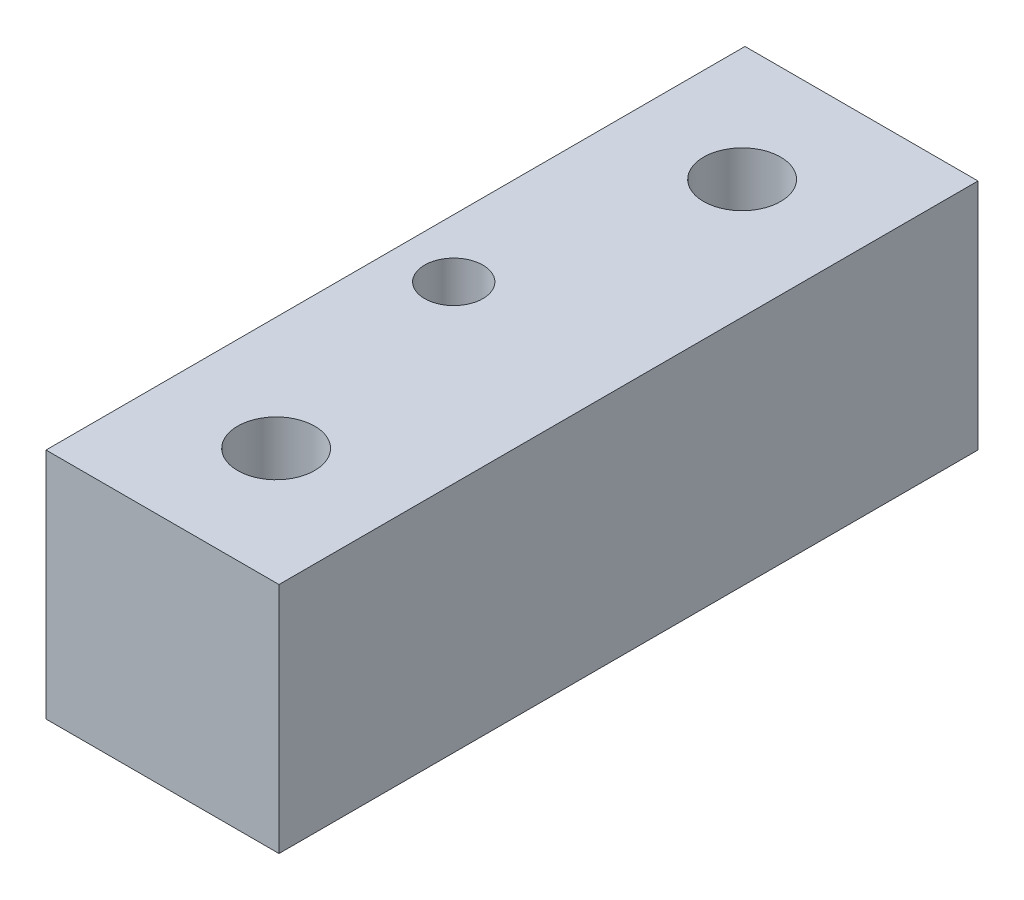
ISO-10303-21;
HEADER;
FILE_DESCRIPTION(('STEP AP214'),'2;1');
FILE_NAME('part.step','',(''),(''),'','','');
FILE_SCHEMA(('AUTOMOTIVE_DESIGN { 1 0 10303 214 1 1 1 1 }'));
ENDSEC;
DATA;
#1=APPLICATION_CONTEXT('core data for automotive mechanical design processes');
#2=APPLICATION_PROTOCOL_DEFINITION('international standard','automotive_design',2000,#1);
#3=PRODUCT_CONTEXT('',#1,'mechanical');
#4=PRODUCT('Part','Part','',(#3));
#5=PRODUCT_RELATED_PRODUCT_CATEGORY('part','',(#4));
#6=PRODUCT_DEFINITION_FORMATION('','',#4);
#7=PRODUCT_DEFINITION_CONTEXT('part definition',#1,'design');
#8=PRODUCT_DEFINITION('design','',#6,#7);
#9=PRODUCT_DEFINITION_SHAPE('','',#8);
#10=(LENGTH_UNIT() NAMED_UNIT(*) SI_UNIT(.MILLI.,.METRE.));
#11=(NAMED_UNIT(*) PLANE_ANGLE_UNIT() SI_UNIT($,.RADIAN.));
#12=(NAMED_UNIT(*) SI_UNIT($,.STERADIAN.) SOLID_ANGLE_UNIT());
#13=UNCERTAINTY_MEASURE_WITH_UNIT(LENGTH_MEASURE(1.E-05),#10,'distance_accuracy_value','');
#14=(GEOMETRIC_REPRESENTATION_CONTEXT(3) GLOBAL_UNCERTAINTY_ASSIGNED_CONTEXT((#13)) GLOBAL_UNIT_ASSIGNED_CONTEXT((#10,
#11,#12)) REPRESENTATION_CONTEXT('',''));
#15=CARTESIAN_POINT('',(0.,0.,0.));
#16=DIRECTION('',(0.,0.,1.));
#17=DIRECTION('',(1.,0.,0.));
#18=AXIS2_PLACEMENT_3D('',#15,#16,#17);
#19=CARTESIAN_POINT('',(0.,0.,38.1));
#20=DIRECTION('',(1.,0.,0.));
#21=DIRECTION('',(0.,0.,-1.));
#22=AXIS2_PLACEMENT_3D('',#19,#20,#21);
#23=PLANE('',#22);
#24=DIRECTION('',(0.,-1.,0.));
#25=VECTOR('',#24,1.);
#26=CARTESIAN_POINT('',(0.,0.,0.));
#27=LINE('',#26,#25);
#28=CARTESIAN_POINT('',(0.,12.7,0.));
#29=VERTEX_POINT('',#28);
#30=CARTESIAN_POINT('',(0.,0.,0.));
#31=VERTEX_POINT('',#30);
#32=EDGE_CURVE('E97',#29,#31,#27,.T.);
#33=ORIENTED_EDGE('',*,*,#32,.T.);
#34=DIRECTION('',(0.,0.,-1.));
#35=VECTOR('',#34,1.);
#36=CARTESIAN_POINT('',(0.,0.,38.1));
#37=LINE('',#36,#35);
#38=CARTESIAN_POINT('',(0.,0.,38.1));
#39=VERTEX_POINT('',#38);
#40=EDGE_CURVE('E11',#39,#31,#37,.T.);
#41=ORIENTED_EDGE('',*,*,#40,.F.);
#42=DIRECTION('',(0.,-1.,0.));
#43=VECTOR('',#42,1.);
#44=CARTESIAN_POINT('',(0.,0.,38.1));
#45=LINE('',#44,#43);
#46=CARTESIAN_POINT('',(0.,12.7,38.1));
#47=VERTEX_POINT('',#46);
#48=EDGE_CURVE('E85',#47,#39,#45,.T.);
#49=ORIENTED_EDGE('',*,*,#48,.F.);
#50=DIRECTION('',(0.,0.,-1.));
#51=VECTOR('',#50,1.);
#52=CARTESIAN_POINT('',(0.,12.7,38.1));
#53=LINE('',#52,#51);
#54=EDGE_CURVE('E93',#47,#29,#53,.T.);
#55=ORIENTED_EDGE('',*,*,#54,.T.);
#56=EDGE_LOOP('',(#33,#41,#49,#55));
#57=FACE_BOUND('',#56,.T.);
#58=ADVANCED_FACE('F34',(#57),#23,.F.);
#59=CARTESIAN_POINT('',(0.,0.,38.1));
#60=DIRECTION('',(0.,1.,0.));
#61=DIRECTION('',(0.,0.,1.));
#62=AXIS2_PLACEMENT_3D('',#59,#60,#61);
#63=PLANE('',#62);
#64=CARTESIAN_POINT('',(3.175,0.,19.05));
#65=DIRECTION('',(0.,1.,0.));
#66=DIRECTION('',(0.,0.,1.));
#67=AXIS2_PLACEMENT_3D('',#64,#65,#66);
#68=CIRCLE('',#67,1.5875);
#69=CARTESIAN_POINT('',(3.175,0.,20.6375));
#70=VERTEX_POINT('',#69);
#71=EDGE_CURVE('E122',#70,#70,#68,.T.);
#72=ORIENTED_EDGE('',*,*,#71,.T.);
#73=EDGE_LOOP('',(#72));
#74=FACE_BOUND('',#73,.T.);
#75=CARTESIAN_POINT('',(6.19329544718994,0.,6.35));
#76=DIRECTION('',(0.,1.,0.));
#77=DIRECTION('',(0.,0.,1.));
#78=AXIS2_PLACEMENT_3D('',#75,#76,#77);
#79=CIRCLE('',#78,2.1);
#80=CARTESIAN_POINT('',(6.19329544718994,0.,8.45));
#81=VERTEX_POINT('',#80);
#82=EDGE_CURVE('E116',#81,#81,#79,.T.);
#83=ORIENTED_EDGE('',*,*,#82,.T.);
#84=EDGE_LOOP('',(#83));
#85=FACE_BOUND('',#84,.T.);
#86=CARTESIAN_POINT('',(6.19329544718994,0.,31.75));
#87=DIRECTION('',(0.,1.,0.));
#88=DIRECTION('',(0.,0.,1.));
#89=AXIS2_PLACEMENT_3D('',#86,#87,#88);
#90=CIRCLE('',#89,2.1);
#91=CARTESIAN_POINT('',(6.19329544718994,0.,33.85));
#92=VERTEX_POINT('',#91);
#93=EDGE_CURVE('E100',#92,#92,#90,.T.);
#94=ORIENTED_EDGE('',*,*,#93,.T.);
#95=EDGE_LOOP('',(#94));
#96=FACE_BOUND('',#95,.T.);
#97=DIRECTION('',(1.,0.,0.));
#98=VECTOR('',#97,1.);
#99=CARTESIAN_POINT('',(0.,0.,0.));
#100=LINE('',#99,#98);
#101=CARTESIAN_POINT('',(12.7,0.,0.));
#102=VERTEX_POINT('',#101);
#103=EDGE_CURVE('E89',#31,#102,#100,.T.);
#104=ORIENTED_EDGE('',*,*,#103,.T.);
#105=DIRECTION('',(0.,0.,-1.));
#106=VECTOR('',#105,1.);
#107=CARTESIAN_POINT('',(12.7,0.,38.1));
#108=LINE('',#107,#106);
#109=CARTESIAN_POINT('',(12.7,0.,38.1));
#110=VERTEX_POINT('',#109);
#111=EDGE_CURVE('E42',#110,#102,#108,.T.);
#112=ORIENTED_EDGE('',*,*,#111,.F.);
#113=DIRECTION('',(1.,0.,0.));
#114=VECTOR('',#113,1.);
#115=CARTESIAN_POINT('',(0.,0.,38.1));
#116=LINE('',#115,#114);
#117=EDGE_CURVE('E80',#39,#110,#116,.T.);
#118=ORIENTED_EDGE('',*,*,#117,.F.);
#119=ORIENTED_EDGE('',*,*,#40,.T.);
#120=EDGE_LOOP('',(#104,#112,#118,#119));
#121=FACE_BOUND('',#120,.T.);
#122=ADVANCED_FACE('F88',(#74,#85,#96,#121),#63,.F.);
#123=CARTESIAN_POINT('',(12.7,0.,38.1));
#124=DIRECTION('',(-1.,0.,0.));
#125=DIRECTION('',(0.,-1.,0.));
#126=AXIS2_PLACEMENT_3D('',#123,#124,#125);
#127=PLANE('',#126);
#128=DIRECTION('',(0.,1.,0.));
#129=VECTOR('',#128,1.);
#130=CARTESIAN_POINT('',(12.7,0.,0.));
#131=LINE('',#130,#129);
#132=CARTESIAN_POINT('',(12.7,12.7,0.));
#133=VERTEX_POINT('',#132);
#134=EDGE_CURVE('E67',#102,#133,#131,.T.);
#135=ORIENTED_EDGE('',*,*,#134,.T.);
#136=DIRECTION('',(0.,0.,-1.));
#137=VECTOR('',#136,1.);
#138=CARTESIAN_POINT('',(12.7,12.7,38.1));
#139=LINE('',#138,#137);
#140=CARTESIAN_POINT('',(12.7,12.7,38.1));
#141=VERTEX_POINT('',#140);
#142=EDGE_CURVE('E90',#141,#133,#139,.T.);
#143=ORIENTED_EDGE('',*,*,#142,.F.);
#144=DIRECTION('',(0.,1.,0.));
#145=VECTOR('',#144,1.);
#146=CARTESIAN_POINT('',(12.7,0.,38.1));
#147=LINE('',#146,#145);
#148=EDGE_CURVE('E83',#110,#141,#147,.T.);
#149=ORIENTED_EDGE('',*,*,#148,.F.);
#150=ORIENTED_EDGE('',*,*,#111,.T.);
#151=EDGE_LOOP('',(#135,#143,#149,#150));
#152=FACE_BOUND('',#151,.T.);
#153=ADVANCED_FACE('F91',(#152),#127,.F.);
#154=CARTESIAN_POINT('',(0.,12.7,38.1));
#155=DIRECTION('',(0.,-1.,0.));
#156=DIRECTION('',(0.,0.,-1.));
#157=AXIS2_PLACEMENT_3D('',#154,#155,#156);
#158=PLANE('',#157);
#159=CARTESIAN_POINT('',(3.175,12.7,19.05));
#160=DIRECTION('',(0.,1.,0.));
#161=DIRECTION('',(0.,0.,1.));
#162=AXIS2_PLACEMENT_3D('',#159,#160,#161);
#163=CIRCLE('',#162,1.58749999999999);
#164=CARTESIAN_POINT('',(3.175,12.7,20.6375));
#165=VERTEX_POINT('',#164);
#166=EDGE_CURVE('E125',#165,#165,#163,.T.);
#167=ORIENTED_EDGE('',*,*,#166,.F.);
#168=EDGE_LOOP('',(#167));
#169=FACE_BOUND('',#168,.T.);
#170=CARTESIAN_POINT('',(6.19329544718994,12.7,6.35));
#171=DIRECTION('',(0.,1.,0.));
#172=DIRECTION('',(0.,0.,1.));
#173=AXIS2_PLACEMENT_3D('',#170,#171,#172);
#174=CIRCLE('',#173,2.09999999999999);
#175=CARTESIAN_POINT('',(6.19329544718994,12.7,8.44999999999999));
#176=VERTEX_POINT('',#175);
#177=EDGE_CURVE('E119',#176,#176,#174,.T.);
#178=ORIENTED_EDGE('',*,*,#177,.F.);
#179=EDGE_LOOP('',(#178));
#180=FACE_BOUND('',#179,.T.);
#181=CARTESIAN_POINT('',(6.19329544718994,12.7,31.75));
#182=DIRECTION('',(0.,1.,0.));
#183=DIRECTION('',(0.,0.,1.));
#184=AXIS2_PLACEMENT_3D('',#181,#182,#183);
#185=CIRCLE('',#184,2.09999999999999);
#186=CARTESIAN_POINT('',(6.19329544718994,12.7,33.85));
#187=VERTEX_POINT('',#186);
#188=EDGE_CURVE('E113',#187,#187,#185,.T.);
#189=ORIENTED_EDGE('',*,*,#188,.F.);
#190=EDGE_LOOP('',(#189));
#191=FACE_BOUND('',#190,.T.);
#192=DIRECTION('',(-1.,0.,0.));
#193=VECTOR('',#192,1.);
#194=CARTESIAN_POINT('',(0.,12.7,0.));
#195=LINE('',#194,#193);
#196=EDGE_CURVE('E73',#133,#29,#195,.T.);
#197=ORIENTED_EDGE('',*,*,#196,.T.);
#198=ORIENTED_EDGE('',*,*,#54,.F.);
#199=DIRECTION('',(-1.,0.,0.));
#200=VECTOR('',#199,1.);
#201=CARTESIAN_POINT('',(0.,12.7,38.1));
#202=LINE('',#201,#200);
#203=EDGE_CURVE('E50',#141,#47,#202,.T.);
#204=ORIENTED_EDGE('',*,*,#203,.F.);
#205=ORIENTED_EDGE('',*,*,#142,.T.);
#206=EDGE_LOOP('',(#197,#198,#204,#205));
#207=FACE_BOUND('',#206,.T.);
#208=ADVANCED_FACE('F105',(#169,#180,#191,#207),#158,.F.);
#209=CARTESIAN_POINT('',(0.,0.,38.1));
#210=DIRECTION('',(0.,0.,-1.));
#211=DIRECTION('',(-1.,0.,0.));
#212=AXIS2_PLACEMENT_3D('',#209,#210,#211);
#213=PLANE('',#212);
#214=ORIENTED_EDGE('',*,*,#48,.T.);
#215=ORIENTED_EDGE('',*,*,#117,.T.);
#216=ORIENTED_EDGE('',*,*,#148,.T.);
#217=ORIENTED_EDGE('',*,*,#203,.T.);
#218=EDGE_LOOP('',(#214,#215,#216,#217));
#219=FACE_BOUND('',#218,.T.);
#220=ADVANCED_FACE('F81',(#219),#213,.F.);
#221=CARTESIAN_POINT('',(0.,0.,0.));
#222=DIRECTION('',(0.,0.,-1.));
#223=DIRECTION('',(-1.,0.,0.));
#224=AXIS2_PLACEMENT_3D('',#221,#222,#223);
#225=PLANE('',#224);
#226=ORIENTED_EDGE('',*,*,#32,.F.);
#227=ORIENTED_EDGE('',*,*,#196,.F.);
#228=ORIENTED_EDGE('',*,*,#134,.F.);
#229=ORIENTED_EDGE('',*,*,#103,.F.);
#230=EDGE_LOOP('',(#226,#227,#228,#229));
#231=FACE_BOUND('',#230,.T.);
#232=ADVANCED_FACE('F108',(#231),#225,.T.);
#233=CARTESIAN_POINT('',(6.19329544718994,12.7,31.75));
#234=DIRECTION('',(0.,1.,0.));
#235=DIRECTION('',(0.,0.,1.));
#236=AXIS2_PLACEMENT_3D('',#233,#234,#235);
#237=CYLINDRICAL_SURFACE('',#236,2.09999999999999);
#238=ORIENTED_EDGE('',*,*,#93,.F.);
#239=EDGE_LOOP('',(#238));
#240=FACE_BOUND('',#239,.T.);
#241=ORIENTED_EDGE('',*,*,#188,.T.);
#242=EDGE_LOOP('',(#241));
#243=FACE_BOUND('',#242,.T.);
#244=ADVANCED_FACE('F138',(#240,#243),#237,.F.);
#245=CARTESIAN_POINT('',(6.19329544718994,12.7,6.35));
#246=DIRECTION('',(0.,1.,0.));
#247=DIRECTION('',(0.,0.,1.));
#248=AXIS2_PLACEMENT_3D('',#245,#246,#247);
#249=CYLINDRICAL_SURFACE('',#248,2.09999999999999);
#250=ORIENTED_EDGE('',*,*,#82,.F.);
#251=EDGE_LOOP('',(#250));
#252=FACE_BOUND('',#251,.T.);
#253=ORIENTED_EDGE('',*,*,#177,.T.);
#254=EDGE_LOOP('',(#253));
#255=FACE_BOUND('',#254,.T.);
#256=ADVANCED_FACE('F140',(#252,#255),#249,.F.);
#257=CARTESIAN_POINT('',(3.175,12.7,19.05));
#258=DIRECTION('',(0.,1.,0.));
#259=DIRECTION('',(0.,0.,1.));
#260=AXIS2_PLACEMENT_3D('',#257,#258,#259);
#261=CYLINDRICAL_SURFACE('',#260,1.58749999999999);
#262=ORIENTED_EDGE('',*,*,#71,.F.);
#263=EDGE_LOOP('',(#262));
#264=FACE_BOUND('',#263,.T.);
#265=ORIENTED_EDGE('',*,*,#166,.T.);
#266=EDGE_LOOP('',(#265));
#267=FACE_BOUND('',#266,.T.);
#268=ADVANCED_FACE('F129',(#264,#267),#261,.F.);
#269=CLOSED_SHELL('',(#58,#122,#153,#208,#220,#232,#244,#256,#268));
#270=MANIFOLD_SOLID_BREP('B2',#269);
#271=ADVANCED_BREP_SHAPE_REPRESENTATION('',(#18,#270),#14);
#272=SHAPE_DEFINITION_REPRESENTATION(#9,#271);
ENDSEC;
END-ISO-10303-21;
